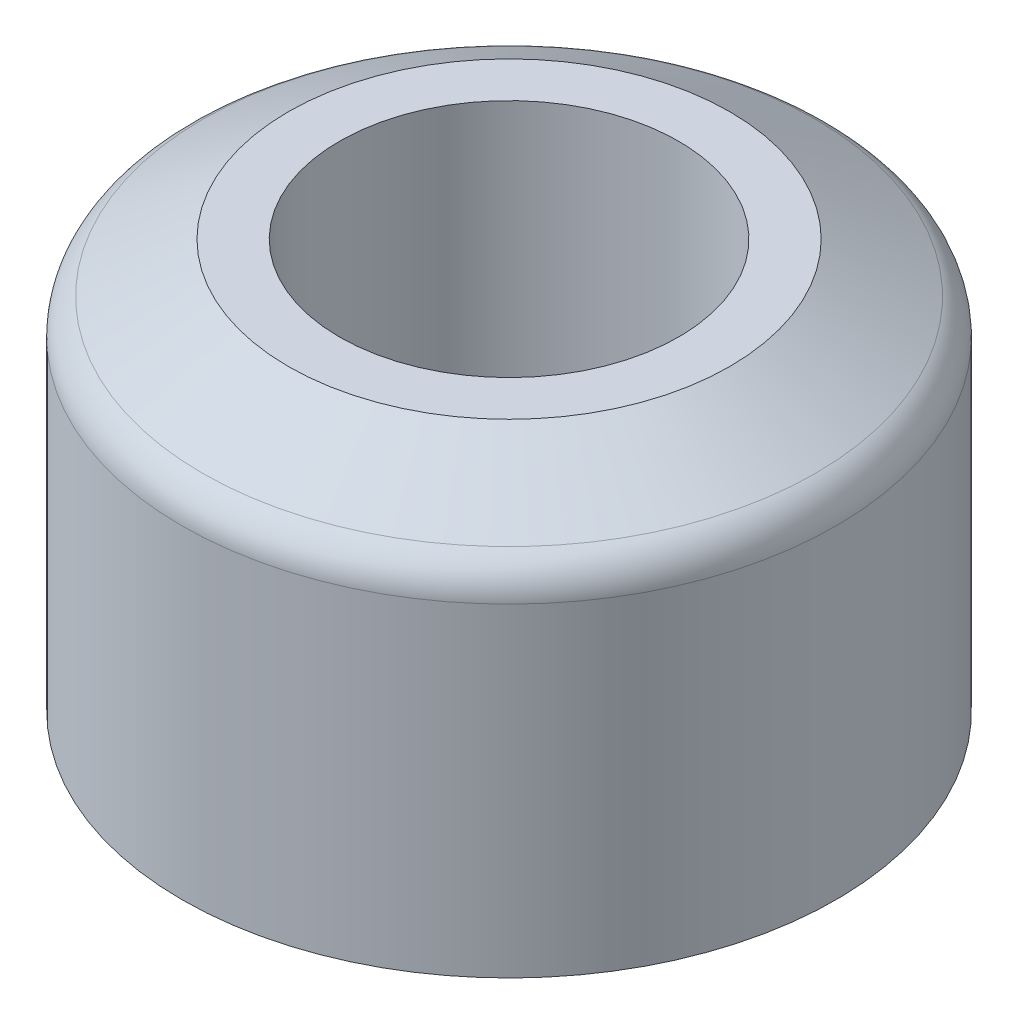
ISO-10303-21;
HEADER;
FILE_DESCRIPTION(('STEP AP214'),'2;1');
FILE_NAME('part.step','',(''),(''),'','','');
FILE_SCHEMA(('AUTOMOTIVE_DESIGN { 1 0 10303 214 1 1 1 1 }'));
ENDSEC;
DATA;
#1=APPLICATION_CONTEXT('core data for automotive mechanical design processes');
#2=APPLICATION_PROTOCOL_DEFINITION('international standard','automotive_design',2000,#1);
#3=PRODUCT_CONTEXT('',#1,'mechanical');
#4=PRODUCT('Part','Part','',(#3));
#5=PRODUCT_RELATED_PRODUCT_CATEGORY('part','',(#4));
#6=PRODUCT_DEFINITION_FORMATION('','',#4);
#7=PRODUCT_DEFINITION_CONTEXT('part definition',#1,'design');
#8=PRODUCT_DEFINITION('design','',#6,#7);
#9=PRODUCT_DEFINITION_SHAPE('','',#8);
#10=(LENGTH_UNIT() NAMED_UNIT(*) SI_UNIT(.MILLI.,.METRE.));
#11=(NAMED_UNIT(*) PLANE_ANGLE_UNIT() SI_UNIT($,.RADIAN.));
#12=(NAMED_UNIT(*) SI_UNIT($,.STERADIAN.) SOLID_ANGLE_UNIT());
#13=UNCERTAINTY_MEASURE_WITH_UNIT(LENGTH_MEASURE(1.E-05),#10,'distance_accuracy_value','');
#14=(GEOMETRIC_REPRESENTATION_CONTEXT(3) GLOBAL_UNCERTAINTY_ASSIGNED_CONTEXT((#13)) GLOBAL_UNIT_ASSIGNED_CONTEXT((#10,
#11,#12)) REPRESENTATION_CONTEXT('',''));
#15=CARTESIAN_POINT('',(0.,0.,0.));
#16=DIRECTION('',(0.,0.,1.));
#17=DIRECTION('',(1.,0.,0.));
#18=AXIS2_PLACEMENT_3D('',#15,#16,#17);
#19=CARTESIAN_POINT('',(0.,10.,0.));
#20=DIRECTION('',(0.,1.,0.));
#21=DIRECTION('',(0.,0.,1.));
#22=AXIS2_PLACEMENT_3D('',#19,#20,#21);
#23=PLANE('',#22);
#24=CARTESIAN_POINT('',(0.,10.,0.));
#25=DIRECTION('',(0.,1.,0.));
#26=DIRECTION('',(0.,0.,1.));
#27=AXIS2_PLACEMENT_3D('',#24,#25,#26);
#28=CIRCLE('',#27,5.39999999999998);
#29=CARTESIAN_POINT('',(0.,10.,5.39999999999998));
#30=VERTEX_POINT('',#29);
#31=EDGE_CURVE('E48',#30,#30,#28,.T.);
#32=ORIENTED_EDGE('',*,*,#31,.T.);
#33=EDGE_LOOP('',(#32));
#34=FACE_BOUND('',#33,.T.);
#35=CARTESIAN_POINT('',(0.,10.,0.));
#36=DIRECTION('',(0.,1.,0.));
#37=DIRECTION('',(0.,0.,1.));
#38=AXIS2_PLACEMENT_3D('',#35,#36,#37);
#39=CIRCLE('',#38,4.15);
#40=CARTESIAN_POINT('',(0.,10.,4.15));
#41=VERTEX_POINT('',#40);
#42=EDGE_CURVE('E57',#41,#41,#39,.T.);
#43=ORIENTED_EDGE('',*,*,#42,.F.);
#44=EDGE_LOOP('',(#43));
#45=FACE_BOUND('',#44,.T.);
#46=ADVANCED_FACE('F37',(#34,#45),#23,.T.);
#47=CARTESIAN_POINT('',(0.,0.,0.));
#48=DIRECTION('',(0.,1.,0.));
#49=DIRECTION('',(0.,0.,1.));
#50=AXIS2_PLACEMENT_3D('',#47,#48,#49);
#51=PLANE('',#50);
#52=CARTESIAN_POINT('',(0.,0.,0.));
#53=DIRECTION('',(0.,1.,0.));
#54=DIRECTION('',(0.,0.,1.));
#55=AXIS2_PLACEMENT_3D('',#52,#53,#54);
#56=CIRCLE('',#55,8.);
#57=CARTESIAN_POINT('',(0.,0.,8.));
#58=VERTEX_POINT('',#57);
#59=EDGE_CURVE('E52',#58,#58,#56,.T.);
#60=ORIENTED_EDGE('',*,*,#59,.F.);
#61=EDGE_LOOP('',(#60));
#62=FACE_BOUND('',#61,.T.);
#63=CARTESIAN_POINT('',(0.,0.,0.));
#64=DIRECTION('',(0.,1.,0.));
#65=DIRECTION('',(0.,0.,1.));
#66=AXIS2_PLACEMENT_3D('',#63,#64,#65);
#67=CIRCLE('',#66,4.15);
#68=CARTESIAN_POINT('',(0.,0.,4.15));
#69=VERTEX_POINT('',#68);
#70=EDGE_CURVE('E58',#69,#69,#67,.T.);
#71=ORIENTED_EDGE('',*,*,#70,.T.);
#72=EDGE_LOOP('',(#71));
#73=FACE_BOUND('',#72,.T.);
#74=ADVANCED_FACE('F68',(#62,#73),#51,.F.);
#75=CARTESIAN_POINT('',(0.,10.,0.));
#76=DIRECTION('',(0.,-1.,0.));
#77=DIRECTION('',(0.,0.,-1.));
#78=AXIS2_PLACEMENT_3D('',#75,#76,#77);
#79=CYLINDRICAL_SURFACE('',#78,8.);
#80=CARTESIAN_POINT('',(0.,7.92153903091734,0.));
#81=DIRECTION('',(0.,1.,0.));
#82=DIRECTION('',(0.,0.,1.));
#83=AXIS2_PLACEMENT_3D('',#80,#81,#82);
#84=CIRCLE('',#83,8.);
#85=CARTESIAN_POINT('',(0.,7.92153903091734,8.));
#86=VERTEX_POINT('',#85);
#87=EDGE_CURVE('E44',#86,#86,#84,.F.);
#88=ORIENTED_EDGE('',*,*,#87,.T.);
#89=EDGE_LOOP('',(#88));
#90=FACE_BOUND('',#89,.T.);
#91=ORIENTED_EDGE('',*,*,#59,.T.);
#92=EDGE_LOOP('',(#91));
#93=FACE_BOUND('',#92,.T.);
#94=ADVANCED_FACE('F74',(#90,#93),#79,.T.);
#95=CARTESIAN_POINT('',(0.,10.,0.));
#96=DIRECTION('',(0.,-1.,0.));
#97=DIRECTION('',(0.,0.,-1.));
#98=AXIS2_PLACEMENT_3D('',#95,#96,#97);
#99=CYLINDRICAL_SURFACE('',#98,4.15);
#100=ORIENTED_EDGE('',*,*,#42,.T.);
#101=EDGE_LOOP('',(#100));
#102=FACE_BOUND('',#101,.T.);
#103=ORIENTED_EDGE('',*,*,#70,.F.);
#104=EDGE_LOOP('',(#103));
#105=FACE_BOUND('',#104,.T.);
#106=ADVANCED_FACE('F64',(#102,#105),#99,.F.);
#107=CARTESIAN_POINT('',(0.,10.,0.));
#108=DIRECTION('',(0.,-1.,0.));
#109=DIRECTION('',(0.,0.,-1.));
#110=AXIS2_PLACEMENT_3D('',#107,#108,#109);
#111=CONICAL_SURFACE('',#110,5.39999999999998,1.0471975511966);
#112=CARTESIAN_POINT('',(0.,8.78756443470178,0.));
#113=DIRECTION('',(0.,-1.,0.));
#114=DIRECTION('',(0.,0.,-1.));
#115=AXIS2_PLACEMENT_3D('',#112,#113,#114);
#116=CIRCLE('',#115,7.5);
#117=CARTESIAN_POINT('',(0.,8.78756443470178,-7.5));
#118=VERTEX_POINT('',#117);
#119=EDGE_CURVE('E10',#118,#118,#116,.F.);
#120=ORIENTED_EDGE('',*,*,#119,.T.);
#121=EDGE_LOOP('',(#120));
#122=FACE_BOUND('',#121,.T.);
#123=ORIENTED_EDGE('',*,*,#31,.F.);
#124=EDGE_LOOP('',(#123));
#125=FACE_BOUND('',#124,.T.);
#126=ADVANCED_FACE('F81',(#122,#125),#111,.T.);
#127=CARTESIAN_POINT('',(0.,7.92153903091734,0.));
#128=DIRECTION('',(0.,1.,0.));
#129=DIRECTION('',(0.,0.,1.));
#130=AXIS2_PLACEMENT_3D('',#127,#128,#129);
#131=TOROIDAL_SURFACE('',#130,7.,1.);
#132=ORIENTED_EDGE('',*,*,#119,.F.);
#133=EDGE_LOOP('',(#132));
#134=FACE_BOUND('',#133,.T.);
#135=ORIENTED_EDGE('',*,*,#87,.F.);
#136=EDGE_LOOP('',(#135));
#137=FACE_BOUND('',#136,.T.);
#138=ADVANCED_FACE('F39',(#134,#137),#131,.T.);
#139=CLOSED_SHELL('',(#46,#74,#94,#106,#126,#138));
#140=MANIFOLD_SOLID_BREP('B2',#139);
#141=ADVANCED_BREP_SHAPE_REPRESENTATION('',(#18,#140),#14);
#142=SHAPE_DEFINITION_REPRESENTATION(#9,#141);
ENDSEC;
END-ISO-10303-21;
